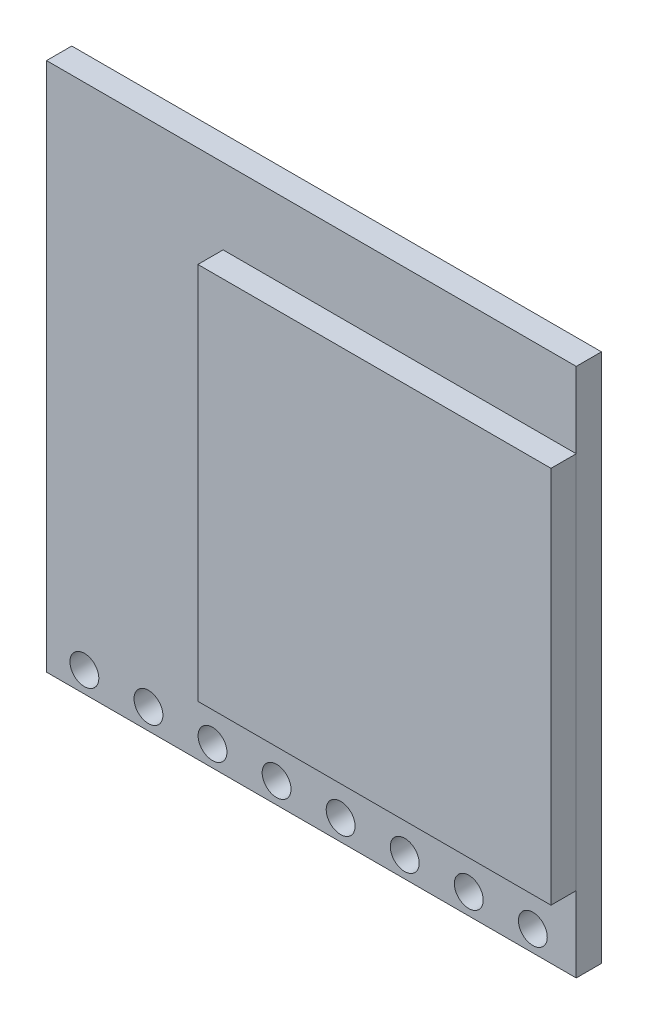
ISO-10303-21;
HEADER;
FILE_DESCRIPTION(('STEP AP214'),'2;1');
FILE_NAME('part.step','',(''),(''),'','','');
FILE_SCHEMA(('AUTOMOTIVE_DESIGN { 1 0 10303 214 1 1 1 1 }'));
ENDSEC;
DATA;
#1=APPLICATION_CONTEXT('core data for automotive mechanical design processes');
#2=APPLICATION_PROTOCOL_DEFINITION('international standard','automotive_design',2000,#1);
#3=PRODUCT_CONTEXT('',#1,'mechanical');
#4=PRODUCT('Part','Part','',(#3));
#5=PRODUCT_RELATED_PRODUCT_CATEGORY('part','',(#4));
#6=PRODUCT_DEFINITION_FORMATION('','',#4);
#7=PRODUCT_DEFINITION_CONTEXT('part definition',#1,'design');
#8=PRODUCT_DEFINITION('design','',#6,#7);
#9=PRODUCT_DEFINITION_SHAPE('','',#8);
#10=(LENGTH_UNIT() NAMED_UNIT(*) SI_UNIT(.MILLI.,.METRE.));
#11=(NAMED_UNIT(*) PLANE_ANGLE_UNIT() SI_UNIT($,.RADIAN.));
#12=(NAMED_UNIT(*) SI_UNIT($,.STERADIAN.) SOLID_ANGLE_UNIT());
#13=UNCERTAINTY_MEASURE_WITH_UNIT(LENGTH_MEASURE(1.E-05),#10,'distance_accuracy_value','');
#14=(GEOMETRIC_REPRESENTATION_CONTEXT(3) GLOBAL_UNCERTAINTY_ASSIGNED_CONTEXT((#13)) GLOBAL_UNIT_ASSIGNED_CONTEXT((#10,
#11,#12)) REPRESENTATION_CONTEXT('',''));
#15=CARTESIAN_POINT('',(0.,0.,0.));
#16=DIRECTION('',(0.,0.,1.));
#17=DIRECTION('',(1.,0.,0.));
#18=AXIS2_PLACEMENT_3D('',#15,#16,#17);
#19=CARTESIAN_POINT('',(21.,18.,2.));
#20=DIRECTION('',(-1.,0.,0.));
#21=DIRECTION('',(0.,0.,1.));
#22=AXIS2_PLACEMENT_3D('',#19,#20,#21);
#23=PLANE('',#22);
#24=DIRECTION('',(0.,1.,0.));
#25=VECTOR('',#24,1.);
#26=CARTESIAN_POINT('',(21.,18.,1.));
#27=LINE('',#26,#25);
#28=CARTESIAN_POINT('',(21.,3.,1.));
#29=VERTEX_POINT('',#28);
#30=CARTESIAN_POINT('',(21.,18.,1.));
#31=VERTEX_POINT('',#30);
#32=EDGE_CURVE('E108',#29,#31,#27,.T.);
#33=ORIENTED_EDGE('',*,*,#32,.T.);
#34=DIRECTION('',(0.,0.,-1.));
#35=VECTOR('',#34,1.);
#36=CARTESIAN_POINT('',(21.,18.,2.));
#37=LINE('',#36,#35);
#38=CARTESIAN_POINT('',(21.,18.,2.));
#39=VERTEX_POINT('',#38);
#40=EDGE_CURVE('E12',#39,#31,#37,.T.);
#41=ORIENTED_EDGE('',*,*,#40,.F.);
#42=DIRECTION('',(0.,1.,0.));
#43=VECTOR('',#42,1.);
#44=CARTESIAN_POINT('',(21.,18.,2.));
#45=LINE('',#44,#43);
#46=CARTESIAN_POINT('',(21.,3.,2.));
#47=VERTEX_POINT('',#46);
#48=EDGE_CURVE('E96',#47,#39,#45,.T.);
#49=ORIENTED_EDGE('',*,*,#48,.F.);
#50=DIRECTION('',(0.,0.,-1.));
#51=VECTOR('',#50,1.);
#52=CARTESIAN_POINT('',(21.,3.,2.));
#53=LINE('',#52,#51);
#54=EDGE_CURVE('E104',#47,#29,#53,.T.);
#55=ORIENTED_EDGE('',*,*,#54,.T.);
#56=EDGE_LOOP('',(#33,#41,#49,#55));
#57=FACE_BOUND('',#56,.T.);
#58=ADVANCED_FACE('F45',(#57),#23,.F.);
#59=CARTESIAN_POINT('',(21.,18.,2.));
#60=DIRECTION('',(0.,-1.,0.));
#61=DIRECTION('',(0.,0.,-1.));
#62=AXIS2_PLACEMENT_3D('',#59,#60,#61);
#63=PLANE('',#62);
#64=DIRECTION('',(-1.,0.,0.));
#65=VECTOR('',#64,1.);
#66=CARTESIAN_POINT('',(21.,18.,1.));
#67=LINE('',#66,#65);
#68=CARTESIAN_POINT('',(7.,18.,1.));
#69=VERTEX_POINT('',#68);
#70=EDGE_CURVE('E100',#31,#69,#67,.T.);
#71=ORIENTED_EDGE('',*,*,#70,.T.);
#72=DIRECTION('',(0.,0.,-1.));
#73=VECTOR('',#72,1.);
#74=CARTESIAN_POINT('',(7.,18.,2.));
#75=LINE('',#74,#73);
#76=CARTESIAN_POINT('',(7.,18.,2.));
#77=VERTEX_POINT('',#76);
#78=EDGE_CURVE('E53',#77,#69,#75,.T.);
#79=ORIENTED_EDGE('',*,*,#78,.F.);
#80=DIRECTION('',(-1.,0.,0.));
#81=VECTOR('',#80,1.);
#82=CARTESIAN_POINT('',(21.,18.,2.));
#83=LINE('',#82,#81);
#84=EDGE_CURVE('E91',#39,#77,#83,.T.);
#85=ORIENTED_EDGE('',*,*,#84,.F.);
#86=ORIENTED_EDGE('',*,*,#40,.T.);
#87=EDGE_LOOP('',(#71,#79,#85,#86));
#88=FACE_BOUND('',#87,.T.);
#89=ADVANCED_FACE('F99',(#88),#63,.F.);
#90=CARTESIAN_POINT('',(7.,18.,2.));
#91=DIRECTION('',(1.,0.,0.));
#92=DIRECTION('',(0.,1.,0.));
#93=AXIS2_PLACEMENT_3D('',#90,#91,#92);
#94=PLANE('',#93);
#95=DIRECTION('',(0.,-1.,0.));
#96=VECTOR('',#95,1.);
#97=CARTESIAN_POINT('',(7.,18.,1.));
#98=LINE('',#97,#96);
#99=CARTESIAN_POINT('',(7.,3.,1.));
#100=VERTEX_POINT('',#99);
#101=EDGE_CURVE('E78',#69,#100,#98,.T.);
#102=ORIENTED_EDGE('',*,*,#101,.T.);
#103=DIRECTION('',(0.,0.,-1.));
#104=VECTOR('',#103,1.);
#105=CARTESIAN_POINT('',(7.,3.,2.));
#106=LINE('',#105,#104);
#107=CARTESIAN_POINT('',(7.,3.,2.));
#108=VERTEX_POINT('',#107);
#109=EDGE_CURVE('E101',#108,#100,#106,.T.);
#110=ORIENTED_EDGE('',*,*,#109,.F.);
#111=DIRECTION('',(0.,-1.,0.));
#112=VECTOR('',#111,1.);
#113=CARTESIAN_POINT('',(7.,18.,2.));
#114=LINE('',#113,#112);
#115=EDGE_CURVE('E94',#77,#108,#114,.T.);
#116=ORIENTED_EDGE('',*,*,#115,.F.);
#117=ORIENTED_EDGE('',*,*,#78,.T.);
#118=EDGE_LOOP('',(#102,#110,#116,#117));
#119=FACE_BOUND('',#118,.T.);
#120=ADVANCED_FACE('F102',(#119),#94,.F.);
#121=CARTESIAN_POINT('',(21.,3.,2.));
#122=DIRECTION('',(0.,1.,0.));
#123=DIRECTION('',(-1.,0.,0.));
#124=AXIS2_PLACEMENT_3D('',#121,#122,#123);
#125=PLANE('',#124);
#126=DIRECTION('',(1.,0.,0.));
#127=VECTOR('',#126,1.);
#128=CARTESIAN_POINT('',(21.,3.,1.));
#129=LINE('',#128,#127);
#130=EDGE_CURVE('E84',#100,#29,#129,.T.);
#131=ORIENTED_EDGE('',*,*,#130,.T.);
#132=ORIENTED_EDGE('',*,*,#54,.F.);
#133=DIRECTION('',(1.,0.,0.));
#134=VECTOR('',#133,1.);
#135=CARTESIAN_POINT('',(21.,3.,2.));
#136=LINE('',#135,#134);
#137=EDGE_CURVE('E61',#108,#47,#136,.T.);
#138=ORIENTED_EDGE('',*,*,#137,.F.);
#139=ORIENTED_EDGE('',*,*,#109,.T.);
#140=EDGE_LOOP('',(#131,#132,#138,#139));
#141=FACE_BOUND('',#140,.T.);
#142=ADVANCED_FACE('F115',(#141),#125,.F.);
#143=CARTESIAN_POINT('',(0.,0.,2.));
#144=DIRECTION('',(0.,0.,-1.));
#145=DIRECTION('',(-1.,0.,0.));
#146=AXIS2_PLACEMENT_3D('',#143,#144,#145);
#147=PLANE('',#146);
#148=ORIENTED_EDGE('',*,*,#48,.T.);
#149=ORIENTED_EDGE('',*,*,#84,.T.);
#150=ORIENTED_EDGE('',*,*,#115,.T.);
#151=ORIENTED_EDGE('',*,*,#137,.T.);
#152=EDGE_LOOP('',(#148,#149,#150,#151));
#153=FACE_BOUND('',#152,.T.);
#154=ADVANCED_FACE('F92',(#153),#147,.F.);
#155=CARTESIAN_POINT('',(0.,0.,1.));
#156=DIRECTION('',(0.,0.,-1.));
#157=DIRECTION('',(-1.,0.,0.));
#158=AXIS2_PLACEMENT_3D('',#155,#156,#157);
#159=PLANE('',#158);
#160=ORIENTED_EDGE('',*,*,#32,.F.);
#161=ORIENTED_EDGE('',*,*,#130,.F.);
#162=ORIENTED_EDGE('',*,*,#101,.F.);
#163=ORIENTED_EDGE('',*,*,#70,.F.);
#164=EDGE_LOOP('',(#160,#161,#162,#163));
#165=FACE_BOUND('',#164,.T.);
#166=ADVANCED_FACE('F118',(#165),#159,.T.);
#167=CLOSED_SHELL('',(#58,#89,#120,#142,#154,#166));
#168=MANIFOLD_SOLID_BREP('B2',#167);
#169=CARTESIAN_POINT('',(0.,0.,1.));
#170=DIRECTION('',(1.,0.,0.));
#171=DIRECTION('',(0.,0.,-1.));
#172=AXIS2_PLACEMENT_3D('',#169,#170,#171);
#173=PLANE('',#172);
#174=DIRECTION('',(0.,-1.,0.));
#175=VECTOR('',#174,1.);
#176=CARTESIAN_POINT('',(0.,0.,0.));
#177=LINE('',#176,#175);
#178=CARTESIAN_POINT('',(0.,21.,0.));
#179=VERTEX_POINT('',#178);
#180=CARTESIAN_POINT('',(0.,0.,0.));
#181=VERTEX_POINT('',#180);
#182=EDGE_CURVE('E232',#179,#181,#177,.T.);
#183=ORIENTED_EDGE('',*,*,#182,.T.);
#184=DIRECTION('',(0.,0.,-1.));
#185=VECTOR('',#184,1.);
#186=CARTESIAN_POINT('',(0.,0.,1.));
#187=LINE('',#186,#185);
#188=CARTESIAN_POINT('',(0.,0.,1.));
#189=VERTEX_POINT('',#188);
#190=EDGE_CURVE('E43',#189,#181,#187,.T.);
#191=ORIENTED_EDGE('',*,*,#190,.F.);
#192=DIRECTION('',(0.,-1.,0.));
#193=VECTOR('',#192,1.);
#194=CARTESIAN_POINT('',(0.,0.,1.));
#195=LINE('',#194,#193);
#196=CARTESIAN_POINT('',(0.,21.,1.));
#197=VERTEX_POINT('',#196);
#198=EDGE_CURVE('E220',#197,#189,#195,.T.);
#199=ORIENTED_EDGE('',*,*,#198,.F.);
#200=DIRECTION('',(0.,0.,-1.));
#201=VECTOR('',#200,1.);
#202=CARTESIAN_POINT('',(0.,21.,1.));
#203=LINE('',#202,#201);
#204=EDGE_CURVE('E228',#197,#179,#203,.T.);
#205=ORIENTED_EDGE('',*,*,#204,.T.);
#206=EDGE_LOOP('',(#183,#191,#199,#205));
#207=FACE_BOUND('',#206,.T.);
#208=ADVANCED_FACE('F169',(#207),#173,.F.);
#209=CARTESIAN_POINT('',(0.,0.,1.));
#210=DIRECTION('',(0.,1.,0.));
#211=DIRECTION('',(0.,0.,1.));
#212=AXIS2_PLACEMENT_3D('',#209,#210,#211);
#213=PLANE('',#212);
#214=DIRECTION('',(1.,0.,0.));
#215=VECTOR('',#214,1.);
#216=CARTESIAN_POINT('',(0.,0.,0.));
#217=LINE('',#216,#215);
#218=CARTESIAN_POINT('',(21.,0.,0.));
#219=VERTEX_POINT('',#218);
#220=EDGE_CURVE('E224',#181,#219,#217,.T.);
#221=ORIENTED_EDGE('',*,*,#220,.T.);
#222=DIRECTION('',(0.,0.,-1.));
#223=VECTOR('',#222,1.);
#224=CARTESIAN_POINT('',(21.,0.,1.));
#225=LINE('',#224,#223);
#226=CARTESIAN_POINT('',(21.,0.,1.));
#227=VERTEX_POINT('',#226);
#228=EDGE_CURVE('E177',#227,#219,#225,.T.);
#229=ORIENTED_EDGE('',*,*,#228,.F.);
#230=DIRECTION('',(1.,0.,0.));
#231=VECTOR('',#230,1.);
#232=CARTESIAN_POINT('',(0.,0.,1.));
#233=LINE('',#232,#231);
#234=EDGE_CURVE('E215',#189,#227,#233,.T.);
#235=ORIENTED_EDGE('',*,*,#234,.F.);
#236=ORIENTED_EDGE('',*,*,#190,.T.);
#237=EDGE_LOOP('',(#221,#229,#235,#236));
#238=FACE_BOUND('',#237,.T.);
#239=ADVANCED_FACE('F223',(#238),#213,.F.);
#240=CARTESIAN_POINT('',(21.,0.,1.));
#241=DIRECTION('',(-1.,0.,0.));
#242=DIRECTION('',(0.,0.,1.));
#243=AXIS2_PLACEMENT_3D('',#240,#241,#242);
#244=PLANE('',#243);
#245=DIRECTION('',(0.,1.,0.));
#246=VECTOR('',#245,1.);
#247=CARTESIAN_POINT('',(21.,0.,0.));
#248=LINE('',#247,#246);
#249=CARTESIAN_POINT('',(21.,21.,0.));
#250=VERTEX_POINT('',#249);
#251=EDGE_CURVE('E202',#219,#250,#248,.T.);
#252=ORIENTED_EDGE('',*,*,#251,.T.);
#253=DIRECTION('',(0.,0.,-1.));
#254=VECTOR('',#253,1.);
#255=CARTESIAN_POINT('',(21.,21.,1.));
#256=LINE('',#255,#254);
#257=CARTESIAN_POINT('',(21.,21.,1.));
#258=VERTEX_POINT('',#257);
#259=EDGE_CURVE('E225',#258,#250,#256,.T.);
#260=ORIENTED_EDGE('',*,*,#259,.F.);
#261=DIRECTION('',(0.,1.,0.));
#262=VECTOR('',#261,1.);
#263=CARTESIAN_POINT('',(21.,0.,1.));
#264=LINE('',#263,#262);
#265=EDGE_CURVE('E218',#227,#258,#264,.T.);
#266=ORIENTED_EDGE('',*,*,#265,.F.);
#267=ORIENTED_EDGE('',*,*,#228,.T.);
#268=EDGE_LOOP('',(#252,#260,#266,#267));
#269=FACE_BOUND('',#268,.T.);
#270=ADVANCED_FACE('F226',(#269),#244,.F.);
#271=CARTESIAN_POINT('',(0.,21.,1.));
#272=DIRECTION('',(0.,-1.,0.));
#273=DIRECTION('',(0.,0.,-1.));
#274=AXIS2_PLACEMENT_3D('',#271,#272,#273);
#275=PLANE('',#274);
#276=DIRECTION('',(-1.,0.,0.));
#277=VECTOR('',#276,1.);
#278=CARTESIAN_POINT('',(0.,21.,0.));
#279=LINE('',#278,#277);
#280=EDGE_CURVE('E208',#250,#179,#279,.T.);
#281=ORIENTED_EDGE('',*,*,#280,.T.);
#282=ORIENTED_EDGE('',*,*,#204,.F.);
#283=DIRECTION('',(-1.,0.,0.));
#284=VECTOR('',#283,1.);
#285=CARTESIAN_POINT('',(0.,21.,1.));
#286=LINE('',#285,#284);
#287=EDGE_CURVE('E185',#258,#197,#286,.T.);
#288=ORIENTED_EDGE('',*,*,#287,.F.);
#289=ORIENTED_EDGE('',*,*,#259,.T.);
#290=EDGE_LOOP('',(#281,#282,#288,#289));
#291=FACE_BOUND('',#290,.T.);
#292=ADVANCED_FACE('F240',(#291),#275,.F.);
#293=CARTESIAN_POINT('',(0.,0.,1.));
#294=DIRECTION('',(0.,0.,-1.));
#295=DIRECTION('',(-1.,0.,0.));
#296=AXIS2_PLACEMENT_3D('',#293,#294,#295);
#297=PLANE('',#296);
#298=CARTESIAN_POINT('',(6.58,0.826638995979713,1.));
#299=DIRECTION('',(0.,0.,1.));
#300=DIRECTION('',(1.,0.,0.));
#301=AXIS2_PLACEMENT_3D('',#298,#299,#300);
#302=CIRCLE('',#301,0.571967695832822);
#303=CARTESIAN_POINT('',(7.15196769583282,0.826638995979713,1.));
#304=VERTEX_POINT('',#303);
#305=EDGE_CURVE('E288',#304,#304,#302,.T.);
#306=ORIENTED_EDGE('',*,*,#305,.F.);
#307=EDGE_LOOP('',(#306));
#308=FACE_BOUND('',#307,.T.);
#309=CARTESIAN_POINT('',(9.12,0.826638995979713,1.));
#310=DIRECTION('',(0.,0.,1.));
#311=DIRECTION('',(1.,0.,0.));
#312=AXIS2_PLACEMENT_3D('',#309,#310,#311);
#313=CIRCLE('',#312,0.571967695832822);
#314=CARTESIAN_POINT('',(9.69196769583282,0.826638995979713,1.));
#315=VERTEX_POINT('',#314);
#316=EDGE_CURVE('E282',#315,#315,#313,.T.);
#317=ORIENTED_EDGE('',*,*,#316,.F.);
#318=EDGE_LOOP('',(#317));
#319=FACE_BOUND('',#318,.T.);
#320=CARTESIAN_POINT('',(11.66,0.826638995979713,1.));
#321=DIRECTION('',(0.,0.,1.));
#322=DIRECTION('',(1.,0.,0.));
#323=AXIS2_PLACEMENT_3D('',#320,#321,#322);
#324=CIRCLE('',#323,0.571967695832822);
#325=CARTESIAN_POINT('',(12.2319676958328,0.826638995979713,1.));
#326=VERTEX_POINT('',#325);
#327=EDGE_CURVE('E276',#326,#326,#324,.T.);
#328=ORIENTED_EDGE('',*,*,#327,.F.);
#329=EDGE_LOOP('',(#328));
#330=FACE_BOUND('',#329,.T.);
#331=CARTESIAN_POINT('',(14.2,0.826638995979713,1.));
#332=DIRECTION('',(0.,0.,1.));
#333=DIRECTION('',(1.,0.,0.));
#334=AXIS2_PLACEMENT_3D('',#331,#332,#333);
#335=CIRCLE('',#334,0.571967695832822);
#336=CARTESIAN_POINT('',(14.7719676958328,0.826638995979713,1.));
#337=VERTEX_POINT('',#336);
#338=EDGE_CURVE('E270',#337,#337,#335,.T.);
#339=ORIENTED_EDGE('',*,*,#338,.F.);
#340=EDGE_LOOP('',(#339));
#341=FACE_BOUND('',#340,.T.);
#342=CARTESIAN_POINT('',(16.74,0.826638995979713,1.));
#343=DIRECTION('',(0.,0.,1.));
#344=DIRECTION('',(1.,0.,0.));
#345=AXIS2_PLACEMENT_3D('',#342,#343,#344);
#346=CIRCLE('',#345,0.571967695832822);
#347=CARTESIAN_POINT('',(17.3119676958328,0.826638995979713,1.));
#348=VERTEX_POINT('',#347);
#349=EDGE_CURVE('E264',#348,#348,#346,.T.);
#350=ORIENTED_EDGE('',*,*,#349,.F.);
#351=EDGE_LOOP('',(#350));
#352=FACE_BOUND('',#351,.T.);
#353=CARTESIAN_POINT('',(19.28,0.826638995979713,1.));
#354=DIRECTION('',(0.,0.,1.));
#355=DIRECTION('',(1.,0.,0.));
#356=AXIS2_PLACEMENT_3D('',#353,#354,#355);
#357=CIRCLE('',#356,0.571967695832822);
#358=CARTESIAN_POINT('',(19.8519676958328,0.826638995979713,1.));
#359=VERTEX_POINT('',#358);
#360=EDGE_CURVE('E258',#359,#359,#357,.T.);
#361=ORIENTED_EDGE('',*,*,#360,.F.);
#362=EDGE_LOOP('',(#361));
#363=FACE_BOUND('',#362,.T.);
#364=CARTESIAN_POINT('',(4.04,0.826638995979713,1.));
#365=DIRECTION('',(0.,0.,1.));
#366=DIRECTION('',(1.,0.,0.));
#367=AXIS2_PLACEMENT_3D('',#364,#365,#366);
#368=CIRCLE('',#367,0.571967695832822);
#369=CARTESIAN_POINT('',(4.61196769583282,0.826638995979713,1.));
#370=VERTEX_POINT('',#369);
#371=EDGE_CURVE('E252',#370,#370,#368,.T.);
#372=ORIENTED_EDGE('',*,*,#371,.F.);
#373=EDGE_LOOP('',(#372));
#374=FACE_BOUND('',#373,.T.);
#375=CARTESIAN_POINT('',(1.5,0.826638995979713,1.));
#376=DIRECTION('',(0.,0.,1.));
#377=DIRECTION('',(1.,0.,0.));
#378=AXIS2_PLACEMENT_3D('',#375,#376,#377);
#379=CIRCLE('',#378,0.571967695832822);
#380=CARTESIAN_POINT('',(2.07196769583282,0.826638995979713,1.));
#381=VERTEX_POINT('',#380);
#382=EDGE_CURVE('E246',#381,#381,#379,.T.);
#383=ORIENTED_EDGE('',*,*,#382,.F.);
#384=EDGE_LOOP('',(#383));
#385=FACE_BOUND('',#384,.T.);
#386=ORIENTED_EDGE('',*,*,#198,.T.);
#387=ORIENTED_EDGE('',*,*,#234,.T.);
#388=ORIENTED_EDGE('',*,*,#265,.T.);
#389=ORIENTED_EDGE('',*,*,#287,.T.);
#390=EDGE_LOOP('',(#386,#387,#388,#389));
#391=FACE_BOUND('',#390,.T.);
#392=ADVANCED_FACE('F216',(#308,#319,#330,#341,#352,#363,#374,#385,#391),#297,.F.);
#393=CARTESIAN_POINT('',(0.,0.,0.));
#394=DIRECTION('',(0.,0.,-1.));
#395=DIRECTION('',(-1.,0.,0.));
#396=AXIS2_PLACEMENT_3D('',#393,#394,#395);
#397=PLANE('',#396);
#398=CARTESIAN_POINT('',(6.58,0.826638995979713,0.));
#399=DIRECTION('',(0.,0.,1.));
#400=DIRECTION('',(1.,0.,0.));
#401=AXIS2_PLACEMENT_3D('',#398,#399,#400);
#402=CIRCLE('',#401,0.571967695832822);
#403=CARTESIAN_POINT('',(7.15196769583282,0.826638995979713,0.));
#404=VERTEX_POINT('',#403);
#405=EDGE_CURVE('E255',#404,#404,#402,.T.);
#406=ORIENTED_EDGE('',*,*,#405,.T.);
#407=EDGE_LOOP('',(#406));
#408=FACE_BOUND('',#407,.T.);
#409=CARTESIAN_POINT('',(9.12,0.826638995979713,0.));
#410=DIRECTION('',(0.,0.,1.));
#411=DIRECTION('',(1.,0.,0.));
#412=AXIS2_PLACEMENT_3D('',#409,#410,#411);
#413=CIRCLE('',#412,0.571967695832822);
#414=CARTESIAN_POINT('',(9.69196769583282,0.826638995979713,0.));
#415=VERTEX_POINT('',#414);
#416=EDGE_CURVE('E285',#415,#415,#413,.T.);
#417=ORIENTED_EDGE('',*,*,#416,.T.);
#418=EDGE_LOOP('',(#417));
#419=FACE_BOUND('',#418,.T.);
#420=CARTESIAN_POINT('',(11.66,0.826638995979713,0.));
#421=DIRECTION('',(0.,0.,1.));
#422=DIRECTION('',(1.,0.,0.));
#423=AXIS2_PLACEMENT_3D('',#420,#421,#422);
#424=CIRCLE('',#423,0.571967695832822);
#425=CARTESIAN_POINT('',(12.2319676958328,0.826638995979713,0.));
#426=VERTEX_POINT('',#425);
#427=EDGE_CURVE('E279',#426,#426,#424,.T.);
#428=ORIENTED_EDGE('',*,*,#427,.T.);
#429=EDGE_LOOP('',(#428));
#430=FACE_BOUND('',#429,.T.);
#431=CARTESIAN_POINT('',(14.2,0.826638995979713,0.));
#432=DIRECTION('',(0.,0.,1.));
#433=DIRECTION('',(1.,0.,0.));
#434=AXIS2_PLACEMENT_3D('',#431,#432,#433);
#435=CIRCLE('',#434,0.571967695832822);
#436=CARTESIAN_POINT('',(14.7719676958328,0.826638995979713,0.));
#437=VERTEX_POINT('',#436);
#438=EDGE_CURVE('E273',#437,#437,#435,.T.);
#439=ORIENTED_EDGE('',*,*,#438,.T.);
#440=EDGE_LOOP('',(#439));
#441=FACE_BOUND('',#440,.T.);
#442=CARTESIAN_POINT('',(16.74,0.826638995979713,0.));
#443=DIRECTION('',(0.,0.,1.));
#444=DIRECTION('',(1.,0.,0.));
#445=AXIS2_PLACEMENT_3D('',#442,#443,#444);
#446=CIRCLE('',#445,0.571967695832822);
#447=CARTESIAN_POINT('',(17.3119676958328,0.826638995979713,0.));
#448=VERTEX_POINT('',#447);
#449=EDGE_CURVE('E267',#448,#448,#446,.T.);
#450=ORIENTED_EDGE('',*,*,#449,.T.);
#451=EDGE_LOOP('',(#450));
#452=FACE_BOUND('',#451,.T.);
#453=CARTESIAN_POINT('',(19.28,0.826638995979713,0.));
#454=DIRECTION('',(0.,0.,1.));
#455=DIRECTION('',(1.,0.,0.));
#456=AXIS2_PLACEMENT_3D('',#453,#454,#455);
#457=CIRCLE('',#456,0.571967695832822);
#458=CARTESIAN_POINT('',(19.8519676958328,0.826638995979713,0.));
#459=VERTEX_POINT('',#458);
#460=EDGE_CURVE('E261',#459,#459,#457,.T.);
#461=ORIENTED_EDGE('',*,*,#460,.T.);
#462=EDGE_LOOP('',(#461));
#463=FACE_BOUND('',#462,.T.);
#464=CARTESIAN_POINT('',(4.04,0.826638995979713,0.));
#465=DIRECTION('',(0.,0.,1.));
#466=DIRECTION('',(1.,0.,0.));
#467=AXIS2_PLACEMENT_3D('',#464,#465,#466);
#468=CIRCLE('',#467,0.571967695832822);
#469=CARTESIAN_POINT('',(4.61196769583282,0.826638995979713,0.));
#470=VERTEX_POINT('',#469);
#471=EDGE_CURVE('E249',#470,#470,#468,.T.);
#472=ORIENTED_EDGE('',*,*,#471,.T.);
#473=EDGE_LOOP('',(#472));
#474=FACE_BOUND('',#473,.T.);
#475=CARTESIAN_POINT('',(1.5,0.826638995979713,0.));
#476=DIRECTION('',(0.,0.,1.));
#477=DIRECTION('',(1.,0.,0.));
#478=AXIS2_PLACEMENT_3D('',#475,#476,#477);
#479=CIRCLE('',#478,0.571967695832822);
#480=CARTESIAN_POINT('',(2.07196769583282,0.826638995979713,0.));
#481=VERTEX_POINT('',#480);
#482=EDGE_CURVE('E235',#481,#481,#479,.T.);
#483=ORIENTED_EDGE('',*,*,#482,.T.);
#484=EDGE_LOOP('',(#483));
#485=FACE_BOUND('',#484,.T.);
#486=ORIENTED_EDGE('',*,*,#182,.F.);
#487=ORIENTED_EDGE('',*,*,#280,.F.);
#488=ORIENTED_EDGE('',*,*,#251,.F.);
#489=ORIENTED_EDGE('',*,*,#220,.F.);
#490=EDGE_LOOP('',(#486,#487,#488,#489));
#491=FACE_BOUND('',#490,.T.);
#492=ADVANCED_FACE('F243',(#408,#419,#430,#441,#452,#463,#474,#485,#491),#397,.T.);
#493=CARTESIAN_POINT('',(1.5,0.826638995979713,0.));
#494=DIRECTION('',(0.,0.,1.));
#495=DIRECTION('',(1.,0.,0.));
#496=AXIS2_PLACEMENT_3D('',#493,#494,#495);
#497=CYLINDRICAL_SURFACE('',#496,0.571967695832822);
#498=ORIENTED_EDGE('',*,*,#482,.F.);
#499=EDGE_LOOP('',(#498));
#500=FACE_BOUND('',#499,.T.);
#501=ORIENTED_EDGE('',*,*,#382,.T.);
#502=EDGE_LOOP('',(#501));
#503=FACE_BOUND('',#502,.T.);
#504=ADVANCED_FACE('F320',(#500,#503),#497,.F.);
#505=CARTESIAN_POINT('',(4.04,0.826638995979713,0.));
#506=DIRECTION('',(0.,0.,1.));
#507=DIRECTION('',(1.,0.,0.));
#508=AXIS2_PLACEMENT_3D('',#505,#506,#507);
#509=CYLINDRICAL_SURFACE('',#508,0.571967695832822);
#510=ORIENTED_EDGE('',*,*,#471,.F.);
#511=EDGE_LOOP('',(#510));
#512=FACE_BOUND('',#511,.T.);
#513=ORIENTED_EDGE('',*,*,#371,.T.);
#514=EDGE_LOOP('',(#513));
#515=FACE_BOUND('',#514,.T.);
#516=ADVANCED_FACE('F322',(#512,#515),#509,.F.);
#517=CARTESIAN_POINT('',(19.28,0.826638995979713,0.));
#518=DIRECTION('',(0.,0.,1.));
#519=DIRECTION('',(1.,0.,0.));
#520=AXIS2_PLACEMENT_3D('',#517,#518,#519);
#521=CYLINDRICAL_SURFACE('',#520,0.571967695832822);
#522=ORIENTED_EDGE('',*,*,#460,.F.);
#523=EDGE_LOOP('',(#522));
#524=FACE_BOUND('',#523,.T.);
#525=ORIENTED_EDGE('',*,*,#360,.T.);
#526=EDGE_LOOP('',(#525));
#527=FACE_BOUND('',#526,.T.);
#528=ADVANCED_FACE('F329',(#524,#527),#521,.F.);
#529=CARTESIAN_POINT('',(16.74,0.826638995979713,0.));
#530=DIRECTION('',(0.,0.,1.));
#531=DIRECTION('',(1.,0.,0.));
#532=AXIS2_PLACEMENT_3D('',#529,#530,#531);
#533=CYLINDRICAL_SURFACE('',#532,0.571967695832822);
#534=ORIENTED_EDGE('',*,*,#449,.F.);
#535=EDGE_LOOP('',(#534));
#536=FACE_BOUND('',#535,.T.);
#537=ORIENTED_EDGE('',*,*,#349,.T.);
#538=EDGE_LOOP('',(#537));
#539=FACE_BOUND('',#538,.T.);
#540=ADVANCED_FACE('F372',(#536,#539),#533,.F.);
#541=CARTESIAN_POINT('',(14.2,0.826638995979713,0.));
#542=DIRECTION('',(0.,0.,1.));
#543=DIRECTION('',(1.,0.,0.));
#544=AXIS2_PLACEMENT_3D('',#541,#542,#543);
#545=CYLINDRICAL_SURFACE('',#544,0.571967695832822);
#546=ORIENTED_EDGE('',*,*,#438,.F.);
#547=EDGE_LOOP('',(#546));
#548=FACE_BOUND('',#547,.T.);
#549=ORIENTED_EDGE('',*,*,#338,.T.);
#550=EDGE_LOOP('',(#549));
#551=FACE_BOUND('',#550,.T.);
#552=ADVANCED_FACE('F382',(#548,#551),#545,.F.);
#553=CARTESIAN_POINT('',(11.66,0.826638995979713,0.));
#554=DIRECTION('',(0.,0.,1.));
#555=DIRECTION('',(1.,0.,0.));
#556=AXIS2_PLACEMENT_3D('',#553,#554,#555);
#557=CYLINDRICAL_SURFACE('',#556,0.571967695832822);
#558=ORIENTED_EDGE('',*,*,#427,.F.);
#559=EDGE_LOOP('',(#558));
#560=FACE_BOUND('',#559,.T.);
#561=ORIENTED_EDGE('',*,*,#327,.T.);
#562=EDGE_LOOP('',(#561));
#563=FACE_BOUND('',#562,.T.);
#564=ADVANCED_FACE('F392',(#560,#563),#557,.F.);
#565=CARTESIAN_POINT('',(9.12,0.826638995979713,0.));
#566=DIRECTION('',(0.,0.,1.));
#567=DIRECTION('',(1.,0.,0.));
#568=AXIS2_PLACEMENT_3D('',#565,#566,#567);
#569=CYLINDRICAL_SURFACE('',#568,0.571967695832822);
#570=ORIENTED_EDGE('',*,*,#416,.F.);
#571=EDGE_LOOP('',(#570));
#572=FACE_BOUND('',#571,.T.);
#573=ORIENTED_EDGE('',*,*,#316,.T.);
#574=EDGE_LOOP('',(#573));
#575=FACE_BOUND('',#574,.T.);
#576=ADVANCED_FACE('F299',(#572,#575),#569,.F.);
#577=CARTESIAN_POINT('',(6.58,0.826638995979713,0.));
#578=DIRECTION('',(0.,0.,1.));
#579=DIRECTION('',(1.,0.,0.));
#580=AXIS2_PLACEMENT_3D('',#577,#578,#579);
#581=CYLINDRICAL_SURFACE('',#580,0.571967695832822);
#582=ORIENTED_EDGE('',*,*,#405,.F.);
#583=EDGE_LOOP('',(#582));
#584=FACE_BOUND('',#583,.T.);
#585=ORIENTED_EDGE('',*,*,#305,.T.);
#586=EDGE_LOOP('',(#585));
#587=FACE_BOUND('',#586,.T.);
#588=ADVANCED_FACE('F296',(#584,#587),#581,.F.);
#589=CLOSED_SHELL('',(#208,#239,#270,#292,#392,#492,#504,#516,#528,#540,#552,#564,#576,#588));
#590=MANIFOLD_SOLID_BREP('B6',#589);
#591=ADVANCED_BREP_SHAPE_REPRESENTATION('',(#18,#168,#590),#14);
#592=SHAPE_DEFINITION_REPRESENTATION(#9,#591);
ENDSEC;
END-ISO-10303-21;
